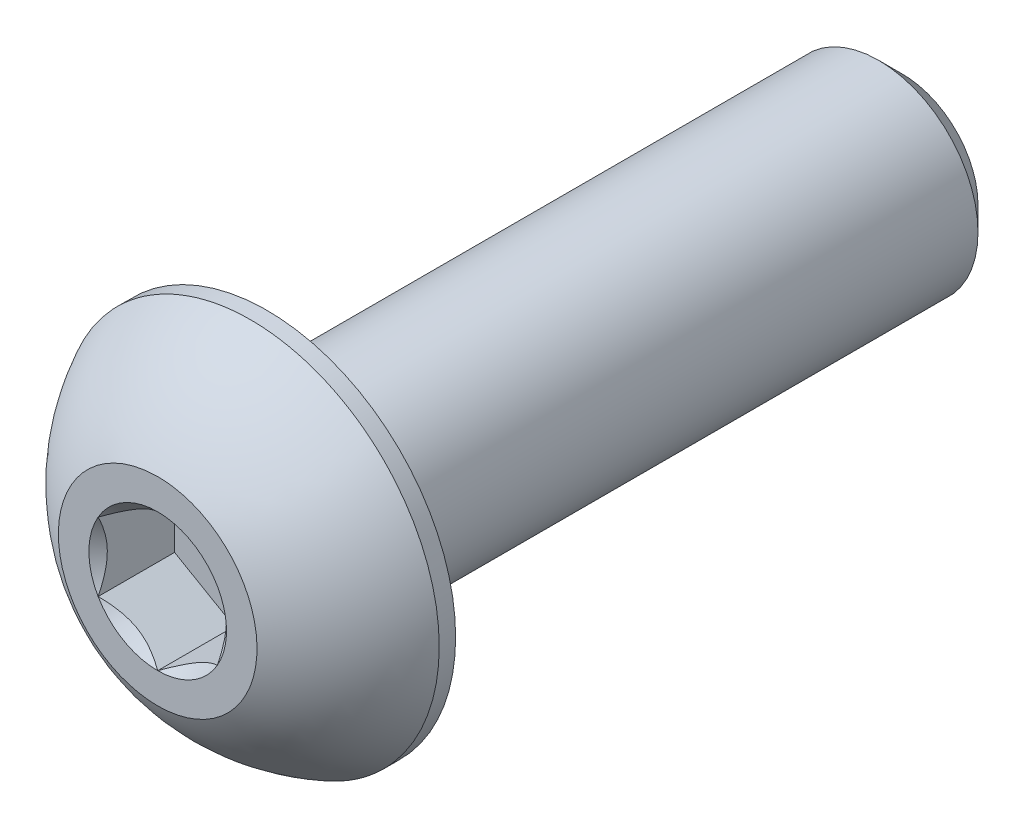
ISO-10303-21;
HEADER;
FILE_DESCRIPTION(('STEP AP214'),'2;1');
FILE_NAME('part.step','',(''),(''),'','','');
FILE_SCHEMA(('AUTOMOTIVE_DESIGN { 1 0 10303 214 1 1 1 1 }'));
ENDSEC;
DATA;
#1=APPLICATION_CONTEXT('core data for automotive mechanical design processes');
#2=APPLICATION_PROTOCOL_DEFINITION('international standard','automotive_design',2000,#1);
#3=PRODUCT_CONTEXT('',#1,'mechanical');
#4=PRODUCT('Part','Part','',(#3));
#5=PRODUCT_RELATED_PRODUCT_CATEGORY('part','',(#4));
#6=PRODUCT_DEFINITION_FORMATION('','',#4);
#7=PRODUCT_DEFINITION_CONTEXT('part definition',#1,'design');
#8=PRODUCT_DEFINITION('design','',#6,#7);
#9=PRODUCT_DEFINITION_SHAPE('','',#8);
#10=(LENGTH_UNIT() NAMED_UNIT(*) SI_UNIT(.MILLI.,.METRE.));
#11=(NAMED_UNIT(*) PLANE_ANGLE_UNIT() SI_UNIT($,.RADIAN.));
#12=(NAMED_UNIT(*) SI_UNIT($,.STERADIAN.) SOLID_ANGLE_UNIT());
#13=UNCERTAINTY_MEASURE_WITH_UNIT(LENGTH_MEASURE(1.E-05),#10,'distance_accuracy_value','');
#14=(GEOMETRIC_REPRESENTATION_CONTEXT(3) GLOBAL_UNCERTAINTY_ASSIGNED_CONTEXT((#13)) GLOBAL_UNIT_ASSIGNED_CONTEXT((#10,
#11,#12)) REPRESENTATION_CONTEXT('',''));
#15=CARTESIAN_POINT('',(0.,0.,0.));
#16=DIRECTION('',(0.,0.,1.));
#17=DIRECTION('',(1.,0.,0.));
#18=AXIS2_PLACEMENT_3D('',#15,#16,#17);
#19=CARTESIAN_POINT('',(1.5,-0.866025403784438,-1.925));
#20=DIRECTION('',(0.,0.,1.));
#21=DIRECTION('',(1.,0.,0.));
#22=AXIS2_PLACEMENT_3D('',#19,#20,#21);
#23=PLANE('',#22);
#24=DIRECTION('',(0.,-1.,0.));
#25=VECTOR('',#24,1.);
#26=CARTESIAN_POINT('',(-1.5,0.866025403784438,-1.925));
#27=LINE('',#26,#25);
#28=CARTESIAN_POINT('',(-1.5,0.866025403784439,-1.925));
#29=VERTEX_POINT('',#28);
#30=CARTESIAN_POINT('',(-1.5,-0.866025403784439,-1.925));
#31=VERTEX_POINT('',#30);
#32=EDGE_CURVE('E67',#29,#31,#27,.T.);
#33=ORIENTED_EDGE('',*,*,#32,.T.);
#34=DIRECTION('',(0.866025403784439,-0.5,0.));
#35=VECTOR('',#34,1.);
#36=CARTESIAN_POINT('',(-1.5,-0.866025403784439,-1.925));
#37=LINE('',#36,#35);
#38=CARTESIAN_POINT('',(0.,-1.73205080756888,-1.925));
#39=VERTEX_POINT('',#38);
#40=EDGE_CURVE('E81',#31,#39,#37,.T.);
#41=ORIENTED_EDGE('',*,*,#40,.T.);
#42=DIRECTION('',(0.866025403784438,0.5,0.));
#43=VECTOR('',#42,1.);
#44=CARTESIAN_POINT('',(0.,-1.73205080756888,-1.925));
#45=LINE('',#44,#43);
#46=CARTESIAN_POINT('',(1.5,-0.86602540378444,-1.925));
#47=VERTEX_POINT('',#46);
#48=EDGE_CURVE('E84',#39,#47,#45,.T.);
#49=ORIENTED_EDGE('',*,*,#48,.T.);
#50=DIRECTION('',(0.,1.,0.));
#51=VECTOR('',#50,1.);
#52=CARTESIAN_POINT('',(1.5,-0.866025403784438,-1.925));
#53=LINE('',#52,#51);
#54=CARTESIAN_POINT('',(1.5,0.866025403784439,-1.925));
#55=VERTEX_POINT('',#54);
#56=EDGE_CURVE('E93',#47,#55,#53,.T.);
#57=ORIENTED_EDGE('',*,*,#56,.T.);
#58=DIRECTION('',(-0.866025403784439,0.5,0.));
#59=VECTOR('',#58,1.);
#60=CARTESIAN_POINT('',(1.5,0.866025403784439,-1.925));
#61=LINE('',#60,#59);
#62=CARTESIAN_POINT('',(0.,1.73205080756888,-1.925));
#63=VERTEX_POINT('',#62);
#64=EDGE_CURVE('E387',#55,#63,#61,.T.);
#65=ORIENTED_EDGE('',*,*,#64,.T.);
#66=DIRECTION('',(-0.866025403784438,-0.5,0.));
#67=VECTOR('',#66,1.);
#68=CARTESIAN_POINT('',(0.,1.73205080756888,-1.925));
#69=LINE('',#68,#67);
#70=EDGE_CURVE('E72',#63,#29,#69,.T.);
#71=ORIENTED_EDGE('',*,*,#70,.T.);
#72=EDGE_LOOP('',(#33,#41,#49,#57,#65,#71));
#73=FACE_BOUND('',#72,.T.);
#74=ADVANCED_FACE('F17',(#73),#23,.T.);
#75=CARTESIAN_POINT('',(-1.5,-0.866025403784439,-1.925));
#76=DIRECTION('',(-0.5,-0.866025403784439,0.));
#77=DIRECTION('',(0.866025403784439,-0.5,0.));
#78=AXIS2_PLACEMENT_3D('',#75,#76,#77);
#79=PLANE('',#78);
#80=CARTESIAN_POINT('',(-1.50000000002453,-0.866025403770049,-3.49737783956075E-11));
#81=CARTESIAN_POINT('',(-1.44844426727117,-0.895791119953617,-0.0297371504849998));
#82=CARTESIAN_POINT('',(-1.39602652187328,-0.926054519369462,-0.05772749973321));
#83=CARTESIAN_POINT('',(-1.28914135977816,-0.987764696477501,-0.108976634295228));
#84=CARTESIAN_POINT('',(-1.23466378385068,-1.01921733960401,-0.132206913925155));
#85=CARTESIAN_POINT('',(-1.12481242363947,-1.08264005199279,-0.172000539063643));
#86=CARTESIAN_POINT('',(-1.06946660011449,-1.11459397810346,-0.188663877355987));
#87=CARTESIAN_POINT('',(-0.95755685533188,-1.17920509937865,-0.214336924391903));
#88=CARTESIAN_POINT('',(-0.900996350293105,-1.21186032218828,-0.223365789908325));
#89=CARTESIAN_POINT('',(-0.803509072843295,-1.26814462806649,-0.231512589340654));
#90=CARTESIAN_POINT('',(-0.762708138141556,-1.29170105869973,-0.232718117543908));
#91=CARTESIAN_POINT('',(-0.68117834074718,-1.33877230917235,-0.230683861819339));
#92=CARTESIAN_POINT('',(-0.640449495964758,-1.36228711867126,-0.22744309593466));
#93=CARTESIAN_POINT('',(-0.559384065201953,-1.40909026694414,-0.216702694706976));
#94=CARTESIAN_POINT('',(-0.519047879504411,-1.4323783746147,-0.20919909909419));
#95=CARTESIAN_POINT('',(-0.439052551258333,-1.47856369891149,-0.19034052638936));
#96=CARTESIAN_POINT('',(-0.399393706909127,-1.50146074337225,-0.178983896683506));
#97=CARTESIAN_POINT('',(-0.297850129661508,-1.56008695503064,-0.145281418581616));
#98=CARTESIAN_POINT('',(-0.236594120185608,-1.59545312859103,-0.120399016466317));
#99=CARTESIAN_POINT('',(-0.146523888893023,-1.64745520087378,-0.0783962697862533));
#100=CARTESIAN_POINT('',(-0.116842951449675,-1.6645914980965,-0.0636393457173693));
#101=CARTESIAN_POINT('',(-0.058026631022432,-1.69854911652791,-0.0327784720806822));
#102=CARTESIAN_POINT('',(-0.0288909964375007,-1.71537058299853,-0.0166751634684281));
#103=CARTESIAN_POINT('',(2.46569689539214E-11,-1.73205080758311,-3.50665873931199E-11));
#104=B_SPLINE_CURVE_WITH_KNOTS('',3,(#80,#81,#82,#83,#84,#85,#86,#87,#88,#89,#90,#91,#92,#93,
#94,#95,#96,#97,#98,#99,#100,#101,#102,#103),.UNSPECIFIED.,.F.,.F.,(4,2,2,2,2,2,2,2,2,2,2,4),
(0.,0.199774419910088,0.400712312277699,0.598459990337993,0.795709985707601,0.936894690871222,
1.07811058146816,1.21945788001607,1.36086588096647,1.58533909988034,1.69726364731887,
1.80913521242832),.UNSPECIFIED.);
#105=CARTESIAN_POINT('',(-1.50000000002135,-0.866025403796765,-2.4650955516094E-11));
#106=VERTEX_POINT('',#105);
#107=CARTESIAN_POINT('',(-3.03586137356069E-11,-1.73205080760065,-1.75293180706268E-11));
#108=VERTEX_POINT('',#107);
#109=EDGE_CURVE('E20',#106,#108,#104,.T.);
#110=ORIENTED_EDGE('',*,*,#109,.T.);
#111=DIRECTION('',(0.,0.,1.));
#112=VECTOR('',#111,1.);
#113=CARTESIAN_POINT('',(0.,-1.73205080756888,-1.925));
#114=LINE('',#113,#112);
#115=EDGE_CURVE('E88',#108,#39,#114,.F.);
#116=ORIENTED_EDGE('',*,*,#115,.T.);
#117=ORIENTED_EDGE('',*,*,#40,.F.);
#118=DIRECTION('',(0.,0.,1.));
#119=VECTOR('',#118,1.);
#120=CARTESIAN_POINT('',(-1.5,-0.866025403784439,-1.925));
#121=LINE('',#120,#119);
#122=EDGE_CURVE('E59',#31,#106,#121,.T.);
#123=ORIENTED_EDGE('',*,*,#122,.T.);
#124=EDGE_LOOP('',(#110,#116,#117,#123));
#125=FACE_BOUND('',#124,.T.);
#126=ADVANCED_FACE('F89',(#125),#79,.F.);
#127=CARTESIAN_POINT('',(0.,-1.73205080756888,-1.925));
#128=DIRECTION('',(0.5,-0.866025403784438,0.));
#129=DIRECTION('',(0.866025403784438,0.5,0.));
#130=AXIS2_PLACEMENT_3D('',#127,#128,#129);
#131=PLANE('',#130);
#132=CARTESIAN_POINT('',(-2.4727404427812E-11,-1.73205080758293,-3.49716199394019E-11));
#133=CARTESIAN_POINT('',(0.0515557327287643,-1.70228509139958,-0.0297371504849976));
#134=CARTESIAN_POINT('',(0.103973478126705,-1.67202169198382,-0.0577274997332079));
#135=CARTESIAN_POINT('',(0.210858640221864,-1.61031151487585,-0.108976634295226));
#136=CARTESIAN_POINT('',(0.26533621614933,-1.57885887174931,-0.132206913925153));
#137=CARTESIAN_POINT('',(0.375187576360525,-1.51543615936052,-0.172000539063641));
#138=CARTESIAN_POINT('',(0.430533399885509,-1.48348223324986,-0.188663877355985));
#139=CARTESIAN_POINT('',(0.542443144668123,-1.41887111197467,-0.214336924391901));
#140=CARTESIAN_POINT('',(0.599003649706897,-1.38621588916504,-0.223365789908323));
#141=CARTESIAN_POINT('',(0.696490927156707,-1.32993158328682,-0.231512589340651));
#142=CARTESIAN_POINT('',(0.737291861858446,-1.30637515265359,-0.232718117543906));
#143=CARTESIAN_POINT('',(0.818821659252822,-1.25930390218097,-0.230683861819337));
#144=CARTESIAN_POINT('',(0.859550504035244,-1.23578909268205,-0.227443095934657));
#145=CARTESIAN_POINT('',(0.940615934798049,-1.18898594440918,-0.216702694706973));
#146=CARTESIAN_POINT('',(0.980952120495592,-1.16569783673862,-0.209199099094188));
#147=CARTESIAN_POINT('',(1.06094744874167,-1.11951251244183,-0.190340526389357));
#148=CARTESIAN_POINT('',(1.10060629309088,-1.09661546798107,-0.178983896683504));
#149=CARTESIAN_POINT('',(1.20214987033849,-1.03798925632268,-0.145281418581613));
#150=CARTESIAN_POINT('',(1.26340587981439,-1.00262308276228,-0.120399016466315));
#151=CARTESIAN_POINT('',(1.35347611110698,-0.950621010479539,-0.0783962697862517));
#152=CARTESIAN_POINT('',(1.38315704855033,-0.933484713256821,-0.063639345717368));
#153=CARTESIAN_POINT('',(1.44197336897757,-0.89952709482541,-0.0327784720806814));
#154=CARTESIAN_POINT('',(1.4711090035625,-0.882705628354789,-0.0166751634684275));
#155=CARTESIAN_POINT('',(1.50000000002466,-0.866025403770207,-3.5066233129564E-11));
#156=B_SPLINE_CURVE_WITH_KNOTS('',3,(#132,#133,#134,#135,#136,#137,#138,#139,#140,#141,#142,
#143,#144,#145,#146,#147,#148,#149,#150,#151,#152,#153,#154,#155),.UNSPECIFIED.,.F.,.F.,(4,2,2,
2,2,2,2,2,2,2,2,4),(0.,0.199774419910088,0.400712312277699,0.598459990337993,0.795709985707601,
0.936894690871222,1.07811058146816,1.21945788001607,1.36086588096647,1.58533909988034,
1.69726364731887,1.80913521242832),.UNSPECIFIED.);
#157=CARTESIAN_POINT('',(1.50000000001233,-0.866025403826621,-1.75289960884086E-11));
#158=VERTEX_POINT('',#157);
#159=EDGE_CURVE('E204',#108,#158,#156,.T.);
#160=ORIENTED_EDGE('',*,*,#159,.T.);
#161=DIRECTION('',(0.,0.,-1.));
#162=VECTOR('',#161,1.);
#163=CARTESIAN_POINT('',(1.5,-0.866025403784439,-1.925));
#164=LINE('',#163,#162);
#165=EDGE_CURVE('E97',#158,#47,#164,.T.);
#166=ORIENTED_EDGE('',*,*,#165,.T.);
#167=ORIENTED_EDGE('',*,*,#48,.F.);
#168=ORIENTED_EDGE('',*,*,#115,.F.);
#169=EDGE_LOOP('',(#160,#166,#167,#168));
#170=FACE_BOUND('',#169,.T.);
#171=ADVANCED_FACE('F95',(#170),#131,.F.);
#172=CARTESIAN_POINT('',(1.5,-0.866025403784438,-1.925));
#173=DIRECTION('',(1.,0.,0.));
#174=DIRECTION('',(0.,0.,-1.));
#175=AXIS2_PLACEMENT_3D('',#172,#173,#174);
#176=PLANE('',#175);
#177=CARTESIAN_POINT('',(1.4999999999998,-0.866025403812882,-3.49731948477309E-11));
#178=CARTESIAN_POINT('',(1.49999999999993,-0.806493971458482,-0.0297371504859724));
#179=CARTESIAN_POINT('',(1.49999999999998,-0.745967172639481,-0.0577274997356717));
#180=CARTESIAN_POINT('',(1.50000000000002,-0.622546818448653,-0.108976634302055));
#181=CARTESIAN_POINT('',(1.50000000000001,-0.559641532208188,-0.132206913934863));
#182=CARTESIAN_POINT('',(1.5,-0.432796107455125,-0.172000539080811));
#183=CARTESIAN_POINT('',(1.5,-0.368888255245699,-0.188663877377684));
#184=CARTESIAN_POINT('',(1.5,-0.239666012718551,-0.214336924424236));
#185=CARTESIAN_POINT('',(1.5,-0.174355567110583,-0.223365789946761));
#186=CARTESIAN_POINT('',(1.5,-0.0617869553803685,-0.231512589389946));
#187=CARTESIAN_POINT('',(1.5,-0.0146740941290635,-0.232718117598397));
#188=CARTESIAN_POINT('',(1.5,0.0794684067864022,-0.230683861885897));
#189=CARTESIAN_POINT('',(1.5,0.126498025769628,-0.227443096008093));
#190=CARTESIAN_POINT('',(1.5,0.220104322286849,-0.216702694795371));
#191=CARTESIAN_POINT('',(1.5,0.266680537614033,-0.209199099190673));
#192=CARTESIAN_POINT('',(1.5,0.359051186180353,-0.190340526502742));
#193=CARTESIAN_POINT('',(1.5,0.404845275088565,-0.178983896805698));
#194=CARTESIAN_POINT('',(1.5,0.522097698449398,-0.145281418704612));
#195=CARTESIAN_POINT('',(1.5,0.592830045625335,-0.120399016572433));
#196=CARTESIAN_POINT('',(1.5,0.69683419026976,-0.0783962698582895));
#197=CARTESIAN_POINT('',(1.5,0.731106784740956,-0.0636393457765502));
#198=CARTESIAN_POINT('',(1.5,0.799022021654026,-0.0327784721118594));
#199=CARTESIAN_POINT('',(1.5,0.832664954619755,-0.0166751634844621));
#200=CARTESIAN_POINT('',(1.5,0.866025403812908,-3.50673015597961E-11));
#201=B_SPLINE_CURVE_WITH_KNOTS('',3,(#177,#178,#179,#180,#181,#182,#183,#184,#185,#186,#187,
#188,#189,#190,#191,#192,#193,#194,#195,#196,#197,#198,#199,#200),.UNSPECIFIED.,.F.,.F.,(4,2,2,
2,2,2,2,2,2,2,2,4),(0.,0.199774419877746,0.400712312213007,0.598459990242251,0.795709985580833,
0.936894690699464,1.07811058125136,1.21945787975417,1.36086588065946,1.58533909974464,
1.69726364726936,1.80913521246463),.UNSPECIFIED.);
#202=CARTESIAN_POINT('',(1.5000000000427,0.866025403774031,-1.75296333077756E-11));
#203=VERTEX_POINT('',#202);
#204=EDGE_CURVE('E186',#158,#203,#201,.T.);
#205=ORIENTED_EDGE('',*,*,#204,.T.);
#206=DIRECTION('',(0.,0.,1.));
#207=VECTOR('',#206,1.);
#208=CARTESIAN_POINT('',(1.5,0.866025403784439,-1.925));
#209=LINE('',#208,#207);
#210=EDGE_CURVE('E380',#203,#55,#209,.F.);
#211=ORIENTED_EDGE('',*,*,#210,.T.);
#212=ORIENTED_EDGE('',*,*,#56,.F.);
#213=ORIENTED_EDGE('',*,*,#165,.F.);
#214=EDGE_LOOP('',(#205,#211,#212,#213));
#215=FACE_BOUND('',#214,.T.);
#216=ADVANCED_FACE('F176',(#215),#176,.F.);
#217=CARTESIAN_POINT('',(1.5,0.866025403784439,-1.925));
#218=DIRECTION('',(0.5,0.866025403784439,0.));
#219=DIRECTION('',(-0.866025403784439,0.5,0.));
#220=AXIS2_PLACEMENT_3D('',#217,#218,#219);
#221=PLANE('',#220);
#222=CARTESIAN_POINT('',(1.50000000002453,0.866025403770048,-3.4973253111955E-11));
#223=CARTESIAN_POINT('',(1.44844426727117,0.895791119953617,-0.0297371504849995));
#224=CARTESIAN_POINT('',(1.39602652187328,0.926054519369461,-0.0577274997332099));
#225=CARTESIAN_POINT('',(1.28914135977816,0.987764696477501,-0.108976634295228));
#226=CARTESIAN_POINT('',(1.23466378385068,1.01921733960401,-0.132206913925156));
#227=CARTESIAN_POINT('',(1.12481242363947,1.08264005199279,-0.172000539063644));
#228=CARTESIAN_POINT('',(1.06946660011449,1.11459397810346,-0.188663877355987));
#229=CARTESIAN_POINT('',(0.95755685533188,1.17920509937865,-0.214336924391904));
#230=CARTESIAN_POINT('',(0.900996350293105,1.21186032218828,-0.223365789908325));
#231=CARTESIAN_POINT('',(0.803509072843295,1.26814462806649,-0.231512589340654));
#232=CARTESIAN_POINT('',(0.762708138141556,1.29170105869973,-0.232718117543908));
#233=CARTESIAN_POINT('',(0.68117834074718,1.33877230917235,-0.230683861819339));
#234=CARTESIAN_POINT('',(0.640449495964758,1.36228711867126,-0.22744309593466));
#235=CARTESIAN_POINT('',(0.559384065201953,1.40909026694414,-0.216702694706976));
#236=CARTESIAN_POINT('',(0.51904787950441,1.4323783746147,-0.20919909909419));
#237=CARTESIAN_POINT('',(0.439052551258333,1.47856369891149,-0.19034052638936));
#238=CARTESIAN_POINT('',(0.399393706909126,1.50146074337225,-0.178983896683506));
#239=CARTESIAN_POINT('',(0.297850129661508,1.56008695503064,-0.145281418581616));
#240=CARTESIAN_POINT('',(0.236594120185608,1.59545312859103,-0.120399016466317));
#241=CARTESIAN_POINT('',(0.146523888893023,1.64745520087378,-0.0783962697862533));
#242=CARTESIAN_POINT('',(0.116842951449675,1.6645914980965,-0.0636393457173695));
#243=CARTESIAN_POINT('',(0.0580266310224324,1.69854911652791,-0.0327784720806825));
#244=CARTESIAN_POINT('',(0.0288909964375013,1.71537058299853,-0.0166751634684285));
#245=CARTESIAN_POINT('',(-2.46561764620561E-11,1.73205080758311,-3.50669956446036E-11));
#246=B_SPLINE_CURVE_WITH_KNOTS('',3,(#222,#223,#224,#225,#226,#227,#228,#229,#230,#231,#232,
#233,#234,#235,#236,#237,#238,#239,#240,#241,#242,#243,#244,#245),.UNSPECIFIED.,.F.,.F.,(4,2,2,
2,2,2,2,2,2,2,2,4),(0.,0.199774419910088,0.400712312277699,0.598459990337994,0.795709985707602,
0.936894690871222,1.07811058146816,1.21945788001607,1.36086588096647,1.58533909988034,
1.69726364731887,1.80913521242832),.UNSPECIFIED.);
#247=CARTESIAN_POINT('',(3.03595659452686E-11,1.73205080760065,-1.75295301999691E-11));
#248=VERTEX_POINT('',#247);
#249=EDGE_CURVE('E180',#203,#248,#246,.T.);
#250=ORIENTED_EDGE('',*,*,#249,.T.);
#251=DIRECTION('',(0.,0.,1.));
#252=VECTOR('',#251,1.);
#253=CARTESIAN_POINT('',(0.,1.73205080756888,-1.925));
#254=LINE('',#253,#252);
#255=EDGE_CURVE('E414',#248,#63,#254,.F.);
#256=ORIENTED_EDGE('',*,*,#255,.T.);
#257=ORIENTED_EDGE('',*,*,#64,.F.);
#258=ORIENTED_EDGE('',*,*,#210,.F.);
#259=EDGE_LOOP('',(#250,#256,#257,#258));
#260=FACE_BOUND('',#259,.T.);
#261=ADVANCED_FACE('F172',(#260),#221,.F.);
#262=CARTESIAN_POINT('',(0.,1.73205080756888,-1.925));
#263=DIRECTION('',(-0.5,0.866025403784438,0.));
#264=DIRECTION('',(-0.866025403784438,-0.5,0.));
#265=AXIS2_PLACEMENT_3D('',#262,#263,#264);
#266=PLANE('',#265);
#267=CARTESIAN_POINT('',(2.47285824502275E-11,1.73205080758293,-3.4971456143468E-11));
#268=CARTESIAN_POINT('',(-0.0515557327287631,1.70228509139958,-0.0297371504849978));
#269=CARTESIAN_POINT('',(-0.103973478126704,1.67202169198382,-0.057727499733208));
#270=CARTESIAN_POINT('',(-0.210858640221863,1.61031151487585,-0.108976634295226));
#271=CARTESIAN_POINT('',(-0.265336216149329,1.57885887174931,-0.132206913925153));
#272=CARTESIAN_POINT('',(-0.375187576360524,1.51543615936052,-0.172000539063641));
#273=CARTESIAN_POINT('',(-0.430533399885509,1.48348223324986,-0.188663877355985));
#274=CARTESIAN_POINT('',(-0.542443144668122,1.41887111197467,-0.214336924391902));
#275=CARTESIAN_POINT('',(-0.599003649706897,1.38621588916503,-0.223365789908323));
#276=CARTESIAN_POINT('',(-0.696490927156706,1.32993158328682,-0.231512589340652));
#277=CARTESIAN_POINT('',(-0.737291861858445,1.30637515265359,-0.232718117543906));
#278=CARTESIAN_POINT('',(-0.818821659252821,1.25930390218097,-0.230683861819337));
#279=CARTESIAN_POINT('',(-0.859550504035243,1.23578909268205,-0.227443095934658));
#280=CARTESIAN_POINT('',(-0.940615934798048,1.18898594440918,-0.216702694706974));
#281=CARTESIAN_POINT('',(-0.980952120495591,1.16569783673862,-0.209199099094188));
#282=CARTESIAN_POINT('',(-1.06094744874167,1.11951251244183,-0.190340526389358));
#283=CARTESIAN_POINT('',(-1.10060629309088,1.09661546798107,-0.178983896683504));
#284=CARTESIAN_POINT('',(-1.20214987033849,1.03798925632268,-0.145281418581613));
#285=CARTESIAN_POINT('',(-1.26340587981439,1.00262308276228,-0.120399016466315));
#286=CARTESIAN_POINT('',(-1.35347611110698,0.950621010479538,-0.0783962697862518));
#287=CARTESIAN_POINT('',(-1.38315704855033,0.933484713256821,-0.0636393457173682));
#288=CARTESIAN_POINT('',(-1.44197336897757,0.899527094825409,-0.0327784720806815));
#289=CARTESIAN_POINT('',(-1.4711090035625,0.882705628354789,-0.0166751634684275));
#290=CARTESIAN_POINT('',(-1.50000000002466,0.866025403770206,-3.50659949264669E-11));
#291=B_SPLINE_CURVE_WITH_KNOTS('',3,(#267,#268,#269,#270,#271,#272,#273,#274,#275,#276,#277,
#278,#279,#280,#281,#282,#283,#284,#285,#286,#287,#288,#289,#290),.UNSPECIFIED.,.F.,.F.,(4,2,2,
2,2,2,2,2,2,2,2,4),(0.,0.199774419910088,0.400712312277699,0.598459990337994,0.795709985707602,
0.936894690871222,1.07811058146816,1.21945788001607,1.36086588096647,1.58533909988034,
1.69726364731887,1.80913521242832),.UNSPECIFIED.);
#292=CARTESIAN_POINT('',(-1.50000000001234,0.86602540382662,-1.75291186124796E-11));
#293=VERTEX_POINT('',#292);
#294=EDGE_CURVE('E40',#248,#293,#291,.T.);
#295=ORIENTED_EDGE('',*,*,#294,.T.);
#296=DIRECTION('',(0.,0.,1.));
#297=VECTOR('',#296,1.);
#298=CARTESIAN_POINT('',(-1.5,0.866025403784438,-1.925));
#299=LINE('',#298,#297);
#300=EDGE_CURVE('E405',#293,#29,#299,.F.);
#301=ORIENTED_EDGE('',*,*,#300,.T.);
#302=ORIENTED_EDGE('',*,*,#70,.F.);
#303=ORIENTED_EDGE('',*,*,#255,.F.);
#304=EDGE_LOOP('',(#295,#301,#302,#303));
#305=FACE_BOUND('',#304,.T.);
#306=ADVANCED_FACE('F165',(#305),#266,.F.);
#307=CARTESIAN_POINT('',(-1.5,0.866025403784438,-1.925));
#308=DIRECTION('',(-1.,0.,0.));
#309=DIRECTION('',(0.,-1.,0.));
#310=AXIS2_PLACEMENT_3D('',#307,#308,#309);
#311=PLANE('',#310);
#312=CARTESIAN_POINT('',(-1.4999999999998,0.866025403812881,-3.4973747365913E-11));
#313=CARTESIAN_POINT('',(-1.49999999999993,0.806493971458482,-0.0297371504859728));
#314=CARTESIAN_POINT('',(-1.49999999999998,0.74596717263948,-0.0577274997356719));
#315=CARTESIAN_POINT('',(-1.50000000000002,0.622546818448652,-0.108976634302056));
#316=CARTESIAN_POINT('',(-1.50000000000001,0.559641532208187,-0.132206913934863));
#317=CARTESIAN_POINT('',(-1.5,0.432796107455125,-0.172000539080811));
#318=CARTESIAN_POINT('',(-1.5,0.368888255245698,-0.188663877377684));
#319=CARTESIAN_POINT('',(-1.5,0.239666012718551,-0.214336924424236));
#320=CARTESIAN_POINT('',(-1.5,0.174355567110582,-0.223365789946761));
#321=CARTESIAN_POINT('',(-1.5,0.0617869553803678,-0.231512589389946));
#322=CARTESIAN_POINT('',(-1.5,0.0146740941290628,-0.232718117598397));
#323=CARTESIAN_POINT('',(-1.5,-0.079468406786403,-0.230683861885897));
#324=CARTESIAN_POINT('',(-1.5,-0.126498025769629,-0.227443096008092));
#325=CARTESIAN_POINT('',(-1.5,-0.220104322286849,-0.21670269479537));
#326=CARTESIAN_POINT('',(-1.5,-0.266680537614034,-0.209199099190673));
#327=CARTESIAN_POINT('',(-1.5,-0.359051186180354,-0.190340526502742));
#328=CARTESIAN_POINT('',(-1.5,-0.404845275088565,-0.178983896805698));
#329=CARTESIAN_POINT('',(-1.5,-0.522097698449399,-0.145281418704611));
#330=CARTESIAN_POINT('',(-1.5,-0.592830045625336,-0.120399016572433));
#331=CARTESIAN_POINT('',(-1.5,-0.69683419026976,-0.0783962698582891));
#332=CARTESIAN_POINT('',(-1.5,-0.731106784740957,-0.0636393457765498));
#333=CARTESIAN_POINT('',(-1.5,-0.799022021654027,-0.0327784721118589));
#334=CARTESIAN_POINT('',(-1.5,-0.832664954619756,-0.0166751634844615));
#335=CARTESIAN_POINT('',(-1.5,-0.866025403812909,-3.50666750779327E-11));
#336=B_SPLINE_CURVE_WITH_KNOTS('',3,(#312,#313,#314,#315,#316,#317,#318,#319,#320,#321,#322,
#323,#324,#325,#326,#327,#328,#329,#330,#331,#332,#333,#334,#335),.UNSPECIFIED.,.F.,.F.,(4,2,2,
2,2,2,2,2,2,2,2,4),(0.,0.199774419877746,0.400712312213007,0.59845999024225,0.795709985580832,
0.936894690699464,1.07811058125136,1.21945787975417,1.36086588065945,1.58533909974464,
1.69726364726936,1.80913521246463),.UNSPECIFIED.);
#337=EDGE_CURVE('E145',#293,#106,#336,.T.);
#338=ORIENTED_EDGE('',*,*,#337,.T.);
#339=ORIENTED_EDGE('',*,*,#122,.F.);
#340=ORIENTED_EDGE('',*,*,#32,.F.);
#341=ORIENTED_EDGE('',*,*,#300,.F.);
#342=EDGE_LOOP('',(#338,#339,#340,#341));
#343=FACE_BOUND('',#342,.T.);
#344=ADVANCED_FACE('F161',(#343),#311,.F.);
#345=CARTESIAN_POINT('',(0.,0.,0.));
#346=DIRECTION('',(0.,0.,1.));
#347=DIRECTION('',(1.,0.,0.));
#348=AXIS2_PLACEMENT_3D('',#345,#346,#347);
#349=CONICAL_SURFACE('',#348,1.73205080761818,0.785398163519197);
#350=ORIENTED_EDGE('',*,*,#109,.F.);
#351=CARTESIAN_POINT('',(0.,0.,0.));
#352=DIRECTION('',(0.,0.,1.));
#353=DIRECTION('',(1.,0.,0.));
#354=AXIS2_PLACEMENT_3D('',#351,#352,#353);
#355=CIRCLE('',#354,1.73205080761818);
#356=EDGE_CURVE('E153',#106,#108,#355,.T.);
#357=ORIENTED_EDGE('',*,*,#356,.T.);
#358=EDGE_LOOP('',(#350,#357));
#359=FACE_BOUND('',#358,.T.);
#360=ADVANCED_FACE('F164',(#359),#349,.F.);
#361=CARTESIAN_POINT('',(0.,0.,0.));
#362=DIRECTION('',(0.,0.,1.));
#363=DIRECTION('',(1.,0.,0.));
#364=AXIS2_PLACEMENT_3D('',#361,#362,#363);
#365=CONICAL_SURFACE('',#364,1.73205080761818,0.785398163519197);
#366=ORIENTED_EDGE('',*,*,#159,.F.);
#367=CARTESIAN_POINT('',(0.,0.,0.));
#368=DIRECTION('',(0.,0.,1.));
#369=DIRECTION('',(1.,0.,0.));
#370=AXIS2_PLACEMENT_3D('',#367,#368,#369);
#371=CIRCLE('',#370,1.73205080761818);
#372=EDGE_CURVE('E393',#108,#158,#371,.T.);
#373=ORIENTED_EDGE('',*,*,#372,.T.);
#374=EDGE_LOOP('',(#366,#373));
#375=FACE_BOUND('',#374,.T.);
#376=ADVANCED_FACE('F199',(#375),#365,.F.);
#377=CARTESIAN_POINT('',(0.,0.,0.));
#378=DIRECTION('',(0.,0.,1.));
#379=DIRECTION('',(1.,0.,0.));
#380=AXIS2_PLACEMENT_3D('',#377,#378,#379);
#381=CONICAL_SURFACE('',#380,1.73205080761818,0.785398163397448);
#382=CARTESIAN_POINT('',(0.,0.,0.));
#383=DIRECTION('',(0.,0.,1.));
#384=DIRECTION('',(1.,0.,0.));
#385=AXIS2_PLACEMENT_3D('',#382,#383,#384);
#386=CIRCLE('',#385,1.73205080761818);
#387=EDGE_CURVE('E389',#158,#203,#386,.T.);
#388=ORIENTED_EDGE('',*,*,#387,.T.);
#389=ORIENTED_EDGE('',*,*,#204,.F.);
#390=EDGE_LOOP('',(#388,#389));
#391=FACE_BOUND('',#390,.T.);
#392=ADVANCED_FACE('F195',(#391),#381,.F.);
#393=CARTESIAN_POINT('',(0.,0.,0.));
#394=DIRECTION('',(0.,0.,1.));
#395=DIRECTION('',(1.,0.,0.));
#396=AXIS2_PLACEMENT_3D('',#393,#394,#395);
#397=CONICAL_SURFACE('',#396,1.73205080761818,0.785398163519197);
#398=ORIENTED_EDGE('',*,*,#249,.F.);
#399=CARTESIAN_POINT('',(0.,0.,0.));
#400=DIRECTION('',(0.,0.,1.));
#401=DIRECTION('',(1.,0.,0.));
#402=AXIS2_PLACEMENT_3D('',#399,#400,#401);
#403=CIRCLE('',#402,1.73205080761818);
#404=EDGE_CURVE('E392',#203,#248,#403,.T.);
#405=ORIENTED_EDGE('',*,*,#404,.T.);
#406=EDGE_LOOP('',(#398,#405));
#407=FACE_BOUND('',#406,.T.);
#408=ADVANCED_FACE('F192',(#407),#397,.F.);
#409=CARTESIAN_POINT('',(0.,0.,0.));
#410=DIRECTION('',(0.,0.,1.));
#411=DIRECTION('',(1.,0.,0.));
#412=AXIS2_PLACEMENT_3D('',#409,#410,#411);
#413=CONICAL_SURFACE('',#412,1.73205080761818,0.785398163519197);
#414=ORIENTED_EDGE('',*,*,#294,.F.);
#415=CARTESIAN_POINT('',(0.,0.,0.));
#416=DIRECTION('',(0.,0.,1.));
#417=DIRECTION('',(1.,0.,0.));
#418=AXIS2_PLACEMENT_3D('',#415,#416,#417);
#419=CIRCLE('',#418,1.73205080761818);
#420=EDGE_CURVE('E399',#248,#293,#419,.T.);
#421=ORIENTED_EDGE('',*,*,#420,.T.);
#422=EDGE_LOOP('',(#414,#421));
#423=FACE_BOUND('',#422,.T.);
#424=ADVANCED_FACE('F140',(#423),#413,.F.);
#425=CARTESIAN_POINT('',(0.,0.,0.));
#426=DIRECTION('',(0.,0.,1.));
#427=DIRECTION('',(1.,0.,0.));
#428=AXIS2_PLACEMENT_3D('',#425,#426,#427);
#429=CONICAL_SURFACE('',#428,1.73205080761818,0.785398163397448);
#430=ORIENTED_EDGE('',*,*,#337,.F.);
#431=CARTESIAN_POINT('',(0.,0.,0.));
#432=DIRECTION('',(0.,0.,1.));
#433=DIRECTION('',(1.,0.,0.));
#434=AXIS2_PLACEMENT_3D('',#431,#432,#433);
#435=CIRCLE('',#434,1.73205080761818);
#436=EDGE_CURVE('E125',#293,#106,#435,.T.);
#437=ORIENTED_EDGE('',*,*,#436,.T.);
#438=EDGE_LOOP('',(#430,#437));
#439=FACE_BOUND('',#438,.T.);
#440=ADVANCED_FACE('F135',(#439),#429,.F.);
#441=CARTESIAN_POINT('',(0.,-2.5,0.));
#442=DIRECTION('',(0.,0.,-1.));
#443=DIRECTION('',(-1.,0.,0.));
#444=AXIS2_PLACEMENT_3D('',#441,#442,#443);
#445=PLANE('',#444);
#446=ORIENTED_EDGE('',*,*,#420,.F.);
#447=ORIENTED_EDGE('',*,*,#404,.F.);
#448=ORIENTED_EDGE('',*,*,#387,.F.);
#449=ORIENTED_EDGE('',*,*,#372,.F.);
#450=ORIENTED_EDGE('',*,*,#356,.F.);
#451=ORIENTED_EDGE('',*,*,#436,.F.);
#452=EDGE_LOOP('',(#446,#447,#448,#449,#450,#451));
#453=FACE_BOUND('',#452,.T.);
#454=CARTESIAN_POINT('',(0.,2.5,0.));
#455=CARTESIAN_POINT('',(-0.140426104916171,2.49999377288615,0.));
#456=CARTESIAN_POINT('',(-0.280954031991962,2.48812860484106,3.15786606079497E-13));
#457=CARTESIAN_POINT('',(-0.558139658492382,2.44096074902969,-3.16166902160035E-13));
#458=CARTESIAN_POINT('',(-0.694792493265144,2.40562985309161,-1.1991938830655E-12));
#459=CARTESIAN_POINT('',(-0.960172122561447,2.31253633023374,-1.20166281841789E-12));
#460=CARTESIAN_POINT('',(-1.08890266852496,2.25478441650809,-3.21946211567848E-13));
#461=CARTESIAN_POINT('',(-1.33480476215494,2.11850293856875,3.21866212850881E-13));
#462=CARTESIAN_POINT('',(-1.45197917410753,2.03997854084975,0.));
#463=CARTESIAN_POINT('',(-1.67149637287936,1.86436525899232,0.));
#464=CARTESIAN_POINT('',(-1.77383760642256,1.76727443311113,0.));
#465=CARTESIAN_POINT('',(-1.96077108972063,1.5572853703438,0.));
#466=CARTESIAN_POINT('',(-2.04536264247664,1.44438651299413,0.));
#467=CARTESIAN_POINT('',(-2.19438926048053,1.20599153577205,0.));
#468=CARTESIAN_POINT('',(-2.2588247010994,1.08049565055392,0.));
#469=CARTESIAN_POINT('',(-2.36571190425968,0.820467575206643,0.));
#470=CARTESIAN_POINT('',(-2.40816371100576,0.685935403248266,0.));
#471=CARTESIAN_POINT('',(-2.46987884513361,0.411653235766082,0.));
#472=CARTESIAN_POINT('',(-2.4891421283097,0.271903230295727,0.));
#473=CARTESIAN_POINT('',(-2.50393321907299,-0.00884700938585592,0.));
#474=CARTESIAN_POINT('',(-2.49946106942909,-0.149847241343843,0.));
#475=CARTESIAN_POINT('',(-2.46690834048228,-0.429095661105701,0.));
#476=CARTESIAN_POINT('',(-2.43882775236998,-0.567343847882636,0.));
#477=CARTESIAN_POINT('',(-2.35985521676827,-0.837163810231989,0.));
#478=CARTESIAN_POINT('',(-2.30896324519902,-0.968735578756572,0.));
#479=CARTESIAN_POINT('',(-2.1858126315262,-1.2214675666181,0.));
#480=CARTESIAN_POINT('',(-2.11355399637579,-1.34262778934316,0.));
#481=CARTESIAN_POINT('',(-1.94972129370707,-1.57109730355804,0.));
#482=CARTESIAN_POINT('',(-1.85814723400701,-1.67840660065422,0.));
#483=CARTESIAN_POINT('',(-1.65828316813495,-1.87612814061528,0.));
#484=CARTESIAN_POINT('',(-1.54999315967219,-1.96654038116456,0.));
#485=CARTESIAN_POINT('',(-1.31977122488187,-2.12790126296045,0.));
#486=CARTESIAN_POINT('',(-1.19783929677156,-2.1988499016635,0.));
#487=CARTESIAN_POINT('',(-0.943794829063063,-2.31926953799948,0.));
#488=CARTESIAN_POINT('',(-0.811682289900767,-2.36874053655201,0.));
#489=CARTESIAN_POINT('',(-0.541026888337529,-2.44480055905628,0.));
#490=CARTESIAN_POINT('',(-0.402484026226278,-2.47138958403887,0.));
#491=CARTESIAN_POINT('',(-0.122900797575727,-2.50093087897621,0.));
#492=CARTESIAN_POINT('',(0.018139568963571,-2.50388314893098,3.46961945081868E-13));
#493=CARTESIAN_POINT('',(0.298714091660324,-2.48606712714886,-3.46961960712715E-13));
#494=CARTESIAN_POINT('',(0.438248247749923,-2.46529883434335,-1.29477243391078E-12));
#495=CARTESIAN_POINT('',(0.71184938433979,-2.40063123468837,-1.13730987603765E-12));
#496=CARTESIAN_POINT('',(0.845916364605969,-2.3567319268485,0.));
#497=CARTESIAN_POINT('',(1.10477735834655,-2.24704847617179,0.));
#498=CARTESIAN_POINT('',(1.22957137303277,-2.18126433619494,-1.00916257566668E-12));
#499=CARTESIAN_POINT('',(1.46634390401786,-2.02967864834022,-1.18352788602047E-12));
#500=CARTESIAN_POINT('',(1.57832242207297,-1.94387710320556,-3.16694129312418E-13));
#501=CARTESIAN_POINT('',(1.7862852822064,-1.7546922142879,3.16694257499622E-13));
#502=CARTESIAN_POINT('',(1.8822696178108,-1.6513088633884,0.));
#503=CARTESIAN_POINT('',(2.0555193719421,-1.42989510132749,0.));
#504=CARTESIAN_POINT('',(2.13278478437748,-1.31186468539964,0.));
#505=CARTESIAN_POINT('',(2.2664032406088,-1.06450749101074,0.));
#506=CARTESIAN_POINT('',(2.32275630647994,-0.935180724474358,0.));
#507=CARTESIAN_POINT('',(2.41295047224872,-0.668901974735227,0.));
#508=CARTESIAN_POINT('',(2.4467915805466,-0.531949994377823,0.));
#509=CARTESIAN_POINT('',(2.49100125494042,-0.254308178115883,0.));
#510=CARTESIAN_POINT('',(2.50136977874099,-0.113618335476538,0.));
#511=CARTESIAN_POINT('',(2.49833983643023,0.167504919749228,0.));
#512=CARTESIAN_POINT('',(2.48494141562714,0.307938332823985,0.));
#513=CARTESIAN_POINT('',(2.43475793877014,0.584562794538377,0.));
#514=CARTESIAN_POINT('',(2.39797283569016,0.720753834646849,0.));
#515=CARTESIAN_POINT('',(2.30205936796063,0.985029646530051,0.));
#516=CARTESIAN_POINT('',(2.24293058718862,1.11311426728121,0.));
#517=CARTESIAN_POINT('',(2.10401075902967,1.3575336098139,0.));
#518=CARTESIAN_POINT('',(2.02422052292125,1.47386879269155,0.));
#519=CARTESIAN_POINT('',(1.84625229096995,1.69148114008358,0.));
#520=CARTESIAN_POINT('',(1.74807621990901,1.79275987884253,0.));
#521=CARTESIAN_POINT('',(1.53608575842464,1.97742315380663,0.));
#522=CARTESIAN_POINT('',(1.42226748721669,2.06080323621403,0.));
#523=CARTESIAN_POINT('',(1.18220372565671,2.20730286771332,0.));
#524=CARTESIAN_POINT('',(1.05595232774905,2.27041272419885,0.));
#525=CARTESIAN_POINT('',(0.79474524318476,2.37446817640477,0.));
#526=CARTESIAN_POINT('',(0.659800208998089,2.41544034072841,0.));
#527=CARTESIAN_POINT('',(0.436662637238998,2.46313736176947,0.));
#528=CARTESIAN_POINT('',(0.349919997758221,2.47694359911888,0.));
#529=CARTESIAN_POINT('',(0.175464826042706,2.49537686389633,0.));
#530=CARTESIAN_POINT('',(0.0877522938079665,2.50000389132438,0.));
#531=CARTESIAN_POINT('',(0.,2.5,0.));
#532=B_SPLINE_CURVE_WITH_KNOTS('',3,(#454,#455,#456,#457,#458,#459,#460,#461,#462,#463,#464,
#465,#466,#467,#468,#469,#470,#471,#472,#473,#474,#475,#476,#477,#478,#479,#480,#481,#482,#483,
#484,#485,#486,#487,#488,#489,#490,#491,#492,#493,#494,#495,#496,#497,#498,#499,#500,#501,#502,
#503,#504,#505,#506,#507,#508,#509,#510,#511,#512,#513,#514,#515,#516,#517,#518,#519,#520,#521,
#522,#523,#524,#525,#526,#527,#528,#529,#530,#531),.UNSPECIFIED.,.T.,.F.,(4,2,2,2,2,2,2,2,2,2,2,
2,2,2,2,2,2,2,2,2,2,2,2,2,2,2,2,2,2,2,2,2,2,2,2,2,2,2,4),(0.,0.420958019059748,
0.842422990224611,1.26368682467408,1.68484598149402,2.10604920874208,2.52726897280856,
2.94848089195443,3.36969196412426,3.7909038392729,4.21211495543997,4.63332622878055,
5.05453794675567,5.47574952765963,5.89696093807138,6.31817240620663,6.73938392938708,
7.16059543453285,7.58180692070278,8.00301840687236,8.42422991201778,8.84544143519829,
9.26665290333358,9.68786431374594,10.1090758946506,10.5302876126258,10.9514988859663,
11.3727100021334,11.793921877282,12.2151329494518,12.6363448685977,13.0575646326643,
13.4787678599123,13.8999270167319,14.3211908511815,14.742655822347,15.1636138414069,
15.4266705700074,15.689727298608),.UNSPECIFIED.);
#533=CARTESIAN_POINT('',(0.,2.5,0.));
#534=VERTEX_POINT('',#533);
#535=EDGE_CURVE('E117',#534,#534,#532,.F.);
#536=ORIENTED_EDGE('',*,*,#535,.F.);
#537=EDGE_LOOP('',(#536));
#538=FACE_BOUND('',#537,.T.);
#539=ADVANCED_FACE('F131',(#453,#538),#445,.F.);
#540=CARTESIAN_POINT('',(0.,0.,-4.65805481283422));
#541=DIRECTION('',(0.,-1.,0.));
#542=DIRECTION('',(0.,0.,-1.));
#543=AXIS2_PLACEMENT_3D('',#540,#541,#542);
#544=SPHERICAL_SURFACE('',#543,5.28653711226622);
#545=ORIENTED_EDGE('',*,*,#535,.T.);
#546=EDGE_LOOP('',(#545));
#547=FACE_BOUND('',#546,.T.);
#548=CARTESIAN_POINT('',(0.,0.,-2.3375));
#549=DIRECTION('',(0.,0.,1.));
#550=DIRECTION('',(1.,0.,0.));
#551=AXIS2_PLACEMENT_3D('',#548,#549,#550);
#552=CIRCLE('',#551,4.75);
#553=CARTESIAN_POINT('',(4.75,0.,-2.3375));
#554=VERTEX_POINT('',#553);
#555=EDGE_CURVE('E114',#554,#554,#552,.F.);
#556=ORIENTED_EDGE('',*,*,#555,.F.);
#557=EDGE_LOOP('',(#556));
#558=FACE_BOUND('',#557,.T.);
#559=ADVANCED_FACE('F127',(#547,#558),#544,.T.);
#560=CARTESIAN_POINT('',(0.,0.,0.));
#561=DIRECTION('',(0.,0.,1.));
#562=DIRECTION('',(1.,0.,0.));
#563=AXIS2_PLACEMENT_3D('',#560,#561,#562);
#564=CYLINDRICAL_SURFACE('',#563,4.75);
#565=CARTESIAN_POINT('',(0.,0.,-2.75));
#566=DIRECTION('',(0.,0.,1.));
#567=DIRECTION('',(1.,0.,0.));
#568=AXIS2_PLACEMENT_3D('',#565,#566,#567);
#569=CIRCLE('',#568,4.75);
#570=CARTESIAN_POINT('',(4.75,0.,-2.75));
#571=VERTEX_POINT('',#570);
#572=EDGE_CURVE('E111',#571,#571,#569,.T.);
#573=ORIENTED_EDGE('',*,*,#572,.T.);
#574=EDGE_LOOP('',(#573));
#575=FACE_BOUND('',#574,.T.);
#576=ORIENTED_EDGE('',*,*,#555,.T.);
#577=EDGE_LOOP('',(#576));
#578=FACE_BOUND('',#577,.T.);
#579=ADVANCED_FACE('F235',(#575,#578),#564,.T.);
#580=CARTESIAN_POINT('',(0.,-2.50000000000007,-18.75));
#581=DIRECTION('',(0.,0.,-1.));
#582=DIRECTION('',(0.,1.,0.));
#583=AXIS2_PLACEMENT_3D('',#580,#581,#582);
#584=PLANE('',#583);
#585=CARTESIAN_POINT('',(0.,0.,-18.7499999999545));
#586=DIRECTION('',(0.,0.,1.));
#587=DIRECTION('',(1.,0.,0.));
#588=AXIS2_PLACEMENT_3D('',#585,#586,#587);
#589=CIRCLE('',#588,1.89999999997774);
#590=CARTESIAN_POINT('',(1.89999999997772,0.,-18.7499999999545));
#591=VERTEX_POINT('',#590);
#592=EDGE_CURVE('E108',#591,#591,#589,.T.);
#593=ORIENTED_EDGE('',*,*,#592,.F.);
#594=EDGE_LOOP('',(#593));
#595=FACE_BOUND('',#594,.T.);
#596=ADVANCED_FACE('F232',(#595),#584,.T.);
#597=CARTESIAN_POINT('',(0.,-4.75,-2.75));
#598=DIRECTION('',(0.,0.,1.));
#599=DIRECTION('',(1.,0.,0.));
#600=AXIS2_PLACEMENT_3D('',#597,#598,#599);
#601=PLANE('',#600);
#602=CARTESIAN_POINT('',(0.,0.,-2.75));
#603=DIRECTION('',(0.,0.,1.));
#604=DIRECTION('',(0.,-1.,0.));
#605=AXIS2_PLACEMENT_3D('',#602,#603,#604);
#606=CIRCLE('',#605,2.5);
#607=CARTESIAN_POINT('',(0.,-2.50000000000001,-2.75));
#608=VERTEX_POINT('',#607);
#609=EDGE_CURVE('E31',#608,#608,#606,.F.);
#610=ORIENTED_EDGE('',*,*,#609,.F.);
#611=EDGE_LOOP('',(#610));
#612=FACE_BOUND('',#611,.T.);
#613=ORIENTED_EDGE('',*,*,#572,.F.);
#614=EDGE_LOOP('',(#613));
#615=FACE_BOUND('',#614,.T.);
#616=ADVANCED_FACE('F225',(#612,#615),#601,.F.);
#617=CARTESIAN_POINT('',(0.,0.,-18.1500000000483));
#618=DIRECTION('',(0.,0.,1.));
#619=DIRECTION('',(1.,0.,0.));
#620=AXIS2_PLACEMENT_3D('',#617,#618,#619);
#621=CONICAL_SURFACE('',#620,2.49999999982713,0.785398163350079);
#622=ORIENTED_EDGE('',*,*,#592,.T.);
#623=EDGE_LOOP('',(#622));
#624=FACE_BOUND('',#623,.T.);
#625=CARTESIAN_POINT('',(0.,0.,-18.15));
#626=DIRECTION('',(0.,0.,1.));
#627=DIRECTION('',(0.,-1.,0.));
#628=AXIS2_PLACEMENT_3D('',#625,#626,#627);
#629=CIRCLE('',#628,2.5);
#630=CARTESIAN_POINT('',(0.,-2.5,-18.15));
#631=VERTEX_POINT('',#630);
#632=EDGE_CURVE('E11',#631,#631,#629,.T.);
#633=ORIENTED_EDGE('',*,*,#632,.F.);
#634=EDGE_LOOP('',(#633));
#635=FACE_BOUND('',#634,.T.);
#636=ADVANCED_FACE('F219',(#624,#635),#621,.T.);
#637=CARTESIAN_POINT('',(0.,0.,-32.75));
#638=DIRECTION('',(0.,0.,1.));
#639=DIRECTION('',(0.,-1.,0.));
#640=AXIS2_PLACEMENT_3D('',#637,#638,#639);
#641=CYLINDRICAL_SURFACE('',#640,2.5);
#642=ORIENTED_EDGE('',*,*,#632,.T.);
#643=EDGE_LOOP('',(#642));
#644=FACE_BOUND('',#643,.T.);
#645=ORIENTED_EDGE('',*,*,#609,.T.);
#646=EDGE_LOOP('',(#645));
#647=FACE_BOUND('',#646,.T.);
#648=ADVANCED_FACE('F217',(#644,#647),#641,.T.);
#649=CLOSED_SHELL('',(#74,#126,#171,#216,#261,#306,#344,#360,#376,#392,#408,#424,#440,#539,#559,
#579,#596,#616,#636,#648));
#650=MANIFOLD_SOLID_BREP('B1',#649);
#651=ADVANCED_BREP_SHAPE_REPRESENTATION('',(#18,#650),#14);
#652=SHAPE_DEFINITION_REPRESENTATION(#9,#651);
ENDSEC;
END-ISO-10303-21;
